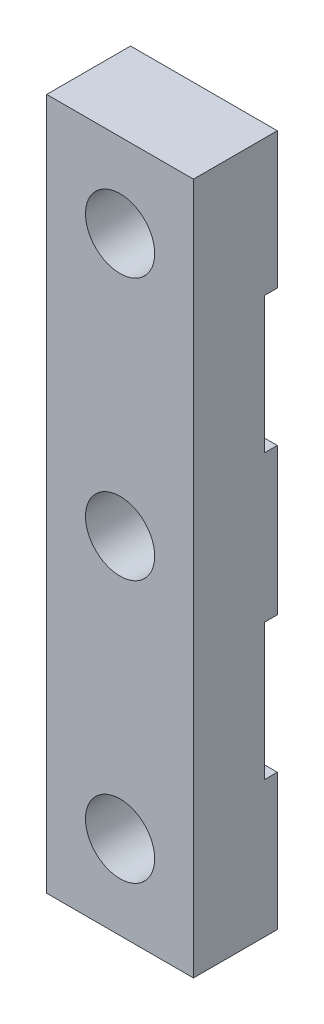
ISO-10303-21;
HEADER;
FILE_DESCRIPTION(('STEP AP214'),'2;1');
FILE_NAME('part.step','',(''),(''),'','','');
FILE_SCHEMA(('AUTOMOTIVE_DESIGN { 1 0 10303 214 1 1 1 1 }'));
ENDSEC;
DATA;
#1=APPLICATION_CONTEXT('core data for automotive mechanical design processes');
#2=APPLICATION_PROTOCOL_DEFINITION('international standard','automotive_design',2000,#1);
#3=PRODUCT_CONTEXT('',#1,'mechanical');
#4=PRODUCT('Part','Part','',(#3));
#5=PRODUCT_RELATED_PRODUCT_CATEGORY('part','',(#4));
#6=PRODUCT_DEFINITION_FORMATION('','',#4);
#7=PRODUCT_DEFINITION_CONTEXT('part definition',#1,'design');
#8=PRODUCT_DEFINITION('design','',#6,#7);
#9=PRODUCT_DEFINITION_SHAPE('','',#8);
#10=(LENGTH_UNIT() NAMED_UNIT(*) SI_UNIT(.MILLI.,.METRE.));
#11=(NAMED_UNIT(*) PLANE_ANGLE_UNIT() SI_UNIT($,.RADIAN.));
#12=(NAMED_UNIT(*) SI_UNIT($,.STERADIAN.) SOLID_ANGLE_UNIT());
#13=UNCERTAINTY_MEASURE_WITH_UNIT(LENGTH_MEASURE(1.E-05),#10,'distance_accuracy_value','');
#14=(GEOMETRIC_REPRESENTATION_CONTEXT(3) GLOBAL_UNCERTAINTY_ASSIGNED_CONTEXT((#13)) GLOBAL_UNIT_ASSIGNED_CONTEXT((#10,
#11,#12)) REPRESENTATION_CONTEXT('',''));
#15=CARTESIAN_POINT('',(0.,0.,0.));
#16=DIRECTION('',(0.,0.,1.));
#17=DIRECTION('',(1.,0.,0.));
#18=AXIS2_PLACEMENT_3D('',#15,#16,#17);
#19=CARTESIAN_POINT('',(0.,0.,0.));
#20=DIRECTION('',(0.,0.,1.));
#21=DIRECTION('',(1.,0.,0.));
#22=AXIS2_PLACEMENT_3D('',#19,#20,#21);
#23=PLANE('',#22);
#24=CARTESIAN_POINT('',(0.,12.5,0.));
#25=DIRECTION('',(0.,0.,1.));
#26=DIRECTION('',(1.,0.,0.));
#27=AXIS2_PLACEMENT_3D('',#24,#25,#26);
#28=CIRCLE('',#27,1.65);
#29=CARTESIAN_POINT('',(1.65,12.5,0.));
#30=VERTEX_POINT('',#29);
#31=EDGE_CURVE('E191',#30,#30,#28,.T.);
#32=ORIENTED_EDGE('',*,*,#31,.T.);
#33=EDGE_LOOP('',(#32));
#34=FACE_BOUND('',#33,.T.);
#35=DIRECTION('',(0.,1.,0.));
#36=VECTOR('',#35,1.);
#37=CARTESIAN_POINT('',(3.5,16.5,0.));
#38=LINE('',#37,#36);
#39=CARTESIAN_POINT('',(3.5,10.,0.));
#40=VERTEX_POINT('',#39);
#41=CARTESIAN_POINT('',(3.5,16.5,0.));
#42=VERTEX_POINT('',#41);
#43=EDGE_CURVE('E146',#40,#42,#38,.T.);
#44=ORIENTED_EDGE('',*,*,#43,.F.);
#45=DIRECTION('',(-1.,0.,0.));
#46=VECTOR('',#45,1.);
#47=CARTESIAN_POINT('',(3.5,10.,0.));
#48=LINE('',#47,#46);
#49=CARTESIAN_POINT('',(-3.5,10.,0.));
#50=VERTEX_POINT('',#49);
#51=EDGE_CURVE('E195',#40,#50,#48,.T.);
#52=ORIENTED_EDGE('',*,*,#51,.T.);
#53=DIRECTION('',(0.,-1.,0.));
#54=VECTOR('',#53,1.);
#55=CARTESIAN_POINT('',(-3.5,16.5,0.));
#56=LINE('',#55,#54);
#57=CARTESIAN_POINT('',(-3.5,16.5,0.));
#58=VERTEX_POINT('',#57);
#59=EDGE_CURVE('E212',#58,#50,#56,.T.);
#60=ORIENTED_EDGE('',*,*,#59,.F.);
#61=DIRECTION('',(-1.,0.,0.));
#62=VECTOR('',#61,1.);
#63=CARTESIAN_POINT('',(-3.5,16.5,0.));
#64=LINE('',#63,#62);
#65=EDGE_CURVE('E149',#42,#58,#64,.T.);
#66=ORIENTED_EDGE('',*,*,#65,.F.);
#67=EDGE_LOOP('',(#44,#52,#60,#66));
#68=FACE_BOUND('',#67,.T.);
#69=ADVANCED_FACE('F32',(#34,#68),#23,.F.);
#70=CARTESIAN_POINT('',(0.,0.,0.));
#71=DIRECTION('',(0.,0.,1.));
#72=DIRECTION('',(1.,0.,0.));
#73=AXIS2_PLACEMENT_3D('',#70,#71,#72);
#74=CIRCLE('',#73,1.65);
#75=CARTESIAN_POINT('',(1.65,0.,0.));
#76=VERTEX_POINT('',#75);
#77=EDGE_CURVE('E199',#76,#76,#74,.T.);
#78=ORIENTED_EDGE('',*,*,#77,.T.);
#79=EDGE_LOOP('',(#78));
#80=FACE_BOUND('',#79,.T.);
#81=CARTESIAN_POINT('',(-3.5,3.5,0.));
#82=VERTEX_POINT('',#81);
#83=CARTESIAN_POINT('',(-3.5,-3.5,0.));
#84=VERTEX_POINT('',#83);
#85=EDGE_CURVE('E138',#82,#84,#56,.T.);
#86=ORIENTED_EDGE('',*,*,#85,.F.);
#87=DIRECTION('',(-1.,0.,0.));
#88=VECTOR('',#87,1.);
#89=CARTESIAN_POINT('',(3.5,3.5,0.));
#90=LINE('',#89,#88);
#91=CARTESIAN_POINT('',(3.5,3.5,0.));
#92=VERTEX_POINT('',#91);
#93=EDGE_CURVE('E124',#92,#82,#90,.T.);
#94=ORIENTED_EDGE('',*,*,#93,.F.);
#95=CARTESIAN_POINT('',(3.5,-3.5,0.));
#96=VERTEX_POINT('',#95);
#97=EDGE_CURVE('E136',#96,#92,#38,.T.);
#98=ORIENTED_EDGE('',*,*,#97,.F.);
#99=DIRECTION('',(-1.,0.,0.));
#100=VECTOR('',#99,1.);
#101=CARTESIAN_POINT('',(3.5,-3.5,0.));
#102=LINE('',#101,#100);
#103=EDGE_CURVE('E231',#96,#84,#102,.T.);
#104=ORIENTED_EDGE('',*,*,#103,.T.);
#105=EDGE_LOOP('',(#86,#94,#98,#104));
#106=FACE_BOUND('',#105,.T.);
#107=ADVANCED_FACE('F134',(#80,#106),#23,.F.);
#108=CARTESIAN_POINT('',(0.,0.,4.));
#109=DIRECTION('',(0.,0.,1.));
#110=DIRECTION('',(1.,0.,0.));
#111=AXIS2_PLACEMENT_3D('',#108,#109,#110);
#112=PLANE('',#111);
#113=CARTESIAN_POINT('',(0.,12.5,4.));
#114=DIRECTION('',(0.,0.,1.));
#115=DIRECTION('',(1.,0.,0.));
#116=AXIS2_PLACEMENT_3D('',#113,#114,#115);
#117=CIRCLE('',#116,1.65);
#118=CARTESIAN_POINT('',(1.65,12.5,4.));
#119=VERTEX_POINT('',#118);
#120=EDGE_CURVE('E196',#119,#119,#117,.T.);
#121=ORIENTED_EDGE('',*,*,#120,.F.);
#122=EDGE_LOOP('',(#121));
#123=FACE_BOUND('',#122,.T.);
#124=DIRECTION('',(0.,-1.,0.));
#125=VECTOR('',#124,1.);
#126=CARTESIAN_POINT('',(-3.5,16.5,4.));
#127=LINE('',#126,#125);
#128=CARTESIAN_POINT('',(-3.5,16.5,4.));
#129=VERTEX_POINT('',#128);
#130=CARTESIAN_POINT('',(-3.5,-16.5,4.));
#131=VERTEX_POINT('',#130);
#132=EDGE_CURVE('E155',#129,#131,#127,.T.);
#133=ORIENTED_EDGE('',*,*,#132,.T.);
#134=DIRECTION('',(1.,0.,0.));
#135=VECTOR('',#134,1.);
#136=CARTESIAN_POINT('',(-3.5,-16.5,4.));
#137=LINE('',#136,#135);
#138=CARTESIAN_POINT('',(3.5,-16.5,4.));
#139=VERTEX_POINT('',#138);
#140=EDGE_CURVE('E209',#131,#139,#137,.T.);
#141=ORIENTED_EDGE('',*,*,#140,.T.);
#142=DIRECTION('',(0.,1.,0.));
#143=VECTOR('',#142,1.);
#144=CARTESIAN_POINT('',(3.5,16.5,4.));
#145=LINE('',#144,#143);
#146=CARTESIAN_POINT('',(3.5,16.5,4.));
#147=VERTEX_POINT('',#146);
#148=EDGE_CURVE('E168',#139,#147,#145,.T.);
#149=ORIENTED_EDGE('',*,*,#148,.T.);
#150=DIRECTION('',(-1.,0.,0.));
#151=VECTOR('',#150,1.);
#152=CARTESIAN_POINT('',(-3.5,16.5,4.));
#153=LINE('',#152,#151);
#154=EDGE_CURVE('E160',#147,#129,#153,.T.);
#155=ORIENTED_EDGE('',*,*,#154,.T.);
#156=EDGE_LOOP('',(#133,#141,#149,#155));
#157=FACE_BOUND('',#156,.T.);
#158=CARTESIAN_POINT('',(0.,0.,4.));
#159=DIRECTION('',(0.,0.,1.));
#160=DIRECTION('',(1.,0.,0.));
#161=AXIS2_PLACEMENT_3D('',#158,#159,#160);
#162=CIRCLE('',#161,1.65);
#163=CARTESIAN_POINT('',(1.65,0.,4.));
#164=VERTEX_POINT('',#163);
#165=EDGE_CURVE('E202',#164,#164,#162,.T.);
#166=ORIENTED_EDGE('',*,*,#165,.F.);
#167=EDGE_LOOP('',(#166));
#168=FACE_BOUND('',#167,.T.);
#169=CARTESIAN_POINT('',(0.,-12.5,4.));
#170=DIRECTION('',(0.,0.,1.));
#171=DIRECTION('',(1.,0.,0.));
#172=AXIS2_PLACEMENT_3D('',#169,#170,#171);
#173=CIRCLE('',#172,1.65);
#174=CARTESIAN_POINT('',(1.65,-12.5,4.));
#175=VERTEX_POINT('',#174);
#176=EDGE_CURVE('E188',#175,#175,#173,.T.);
#177=ORIENTED_EDGE('',*,*,#176,.F.);
#178=EDGE_LOOP('',(#177));
#179=FACE_BOUND('',#178,.T.);
#180=ADVANCED_FACE('F269',(#123,#157,#168,#179),#112,.T.);
#181=CARTESIAN_POINT('',(-3.5,-10.,0.));
#182=VERTEX_POINT('',#181);
#183=CARTESIAN_POINT('',(-3.5,-16.5,0.));
#184=VERTEX_POINT('',#183);
#185=EDGE_CURVE('E177',#182,#184,#56,.T.);
#186=ORIENTED_EDGE('',*,*,#185,.F.);
#187=DIRECTION('',(-1.,0.,0.));
#188=VECTOR('',#187,1.);
#189=CARTESIAN_POINT('',(3.5,-10.,0.));
#190=LINE('',#189,#188);
#191=CARTESIAN_POINT('',(3.5,-10.,0.));
#192=VERTEX_POINT('',#191);
#193=EDGE_CURVE('E176',#192,#182,#190,.T.);
#194=ORIENTED_EDGE('',*,*,#193,.F.);
#195=CARTESIAN_POINT('',(3.5,-16.5,0.));
#196=VERTEX_POINT('',#195);
#197=EDGE_CURVE('E145',#196,#192,#38,.T.);
#198=ORIENTED_EDGE('',*,*,#197,.F.);
#199=DIRECTION('',(1.,0.,0.));
#200=VECTOR('',#199,1.);
#201=CARTESIAN_POINT('',(-3.5,-16.5,0.));
#202=LINE('',#201,#200);
#203=EDGE_CURVE('E150',#184,#196,#202,.T.);
#204=ORIENTED_EDGE('',*,*,#203,.F.);
#205=EDGE_LOOP('',(#186,#194,#198,#204));
#206=FACE_BOUND('',#205,.T.);
#207=CARTESIAN_POINT('',(0.,-12.5,0.));
#208=DIRECTION('',(0.,0.,1.));
#209=DIRECTION('',(1.,0.,0.));
#210=AXIS2_PLACEMENT_3D('',#207,#208,#209);
#211=CIRCLE('',#210,1.65);
#212=CARTESIAN_POINT('',(1.65,-12.5,0.));
#213=VERTEX_POINT('',#212);
#214=EDGE_CURVE('E192',#213,#213,#211,.T.);
#215=ORIENTED_EDGE('',*,*,#214,.T.);
#216=EDGE_LOOP('',(#215));
#217=FACE_BOUND('',#216,.T.);
#218=ADVANCED_FACE('F174',(#206,#217),#23,.F.);
#219=CARTESIAN_POINT('',(-3.5,16.5,4.));
#220=DIRECTION('',(1.,0.,0.));
#221=DIRECTION('',(0.,0.,-1.));
#222=AXIS2_PLACEMENT_3D('',#219,#220,#221);
#223=PLANE('',#222);
#224=ORIENTED_EDGE('',*,*,#59,.T.);
#225=DIRECTION('',(0.,0.,-1.));
#226=VECTOR('',#225,1.);
#227=CARTESIAN_POINT('',(-3.5,10.,0.));
#228=LINE('',#227,#226);
#229=CARTESIAN_POINT('',(-3.5,10.,0.6));
#230=VERTEX_POINT('',#229);
#231=EDGE_CURVE('E129',#230,#50,#228,.T.);
#232=ORIENTED_EDGE('',*,*,#231,.F.);
#233=DIRECTION('',(0.,1.,0.));
#234=VECTOR('',#233,1.);
#235=CARTESIAN_POINT('',(-3.5,10.,0.6));
#236=LINE('',#235,#234);
#237=CARTESIAN_POINT('',(-3.5,3.5,0.600000000000001));
#238=VERTEX_POINT('',#237);
#239=EDGE_CURVE('E238',#238,#230,#236,.T.);
#240=ORIENTED_EDGE('',*,*,#239,.F.);
#241=DIRECTION('',(0.,0.,1.));
#242=VECTOR('',#241,1.);
#243=CARTESIAN_POINT('',(-3.5,3.5,0.));
#244=LINE('',#243,#242);
#245=EDGE_CURVE('E232',#82,#238,#244,.T.);
#246=ORIENTED_EDGE('',*,*,#245,.F.);
#247=ORIENTED_EDGE('',*,*,#85,.T.);
#248=DIRECTION('',(0.,0.,-1.));
#249=VECTOR('',#248,1.);
#250=CARTESIAN_POINT('',(-3.5,-3.5,0.));
#251=LINE('',#250,#249);
#252=CARTESIAN_POINT('',(-3.5,-3.5,0.600000000000002));
#253=VERTEX_POINT('',#252);
#254=EDGE_CURVE('E225',#253,#84,#251,.T.);
#255=ORIENTED_EDGE('',*,*,#254,.F.);
#256=DIRECTION('',(0.,1.,0.));
#257=VECTOR('',#256,1.);
#258=CARTESIAN_POINT('',(-3.5,-3.5,0.600000000000002));
#259=LINE('',#258,#257);
#260=CARTESIAN_POINT('',(-3.5,-10.,0.600000000000002));
#261=VERTEX_POINT('',#260);
#262=EDGE_CURVE('E223',#261,#253,#259,.T.);
#263=ORIENTED_EDGE('',*,*,#262,.F.);
#264=DIRECTION('',(0.,0.,1.));
#265=VECTOR('',#264,1.);
#266=CARTESIAN_POINT('',(-3.5,-10.,0.));
#267=LINE('',#266,#265);
#268=EDGE_CURVE('E220',#182,#261,#267,.T.);
#269=ORIENTED_EDGE('',*,*,#268,.F.);
#270=ORIENTED_EDGE('',*,*,#185,.T.);
#271=DIRECTION('',(0.,0.,-1.));
#272=VECTOR('',#271,1.);
#273=CARTESIAN_POINT('',(-3.5,-16.5,4.));
#274=LINE('',#273,#272);
#275=EDGE_CURVE('E11',#131,#184,#274,.T.);
#276=ORIENTED_EDGE('',*,*,#275,.F.);
#277=ORIENTED_EDGE('',*,*,#132,.F.);
#278=DIRECTION('',(0.,0.,-1.));
#279=VECTOR('',#278,1.);
#280=CARTESIAN_POINT('',(-3.5,16.5,4.));
#281=LINE('',#280,#279);
#282=EDGE_CURVE('E156',#129,#58,#281,.T.);
#283=ORIENTED_EDGE('',*,*,#282,.T.);
#284=EDGE_LOOP('',(#224,#232,#240,#246,#247,#255,#263,#269,#270,#276,#277,#283));
#285=FACE_BOUND('',#284,.T.);
#286=ADVANCED_FACE('F34',(#285),#223,.F.);
#287=CARTESIAN_POINT('',(-3.5,-16.5,4.));
#288=DIRECTION('',(0.,1.,0.));
#289=DIRECTION('',(0.,0.,1.));
#290=AXIS2_PLACEMENT_3D('',#287,#288,#289);
#291=PLANE('',#290);
#292=ORIENTED_EDGE('',*,*,#203,.T.);
#293=DIRECTION('',(0.,0.,-1.));
#294=VECTOR('',#293,1.);
#295=CARTESIAN_POINT('',(3.5,-16.5,4.));
#296=LINE('',#295,#294);
#297=EDGE_CURVE('E40',#139,#196,#296,.T.);
#298=ORIENTED_EDGE('',*,*,#297,.F.);
#299=ORIENTED_EDGE('',*,*,#140,.F.);
#300=ORIENTED_EDGE('',*,*,#275,.T.);
#301=EDGE_LOOP('',(#292,#298,#299,#300));
#302=FACE_BOUND('',#301,.T.);
#303=ADVANCED_FACE('F279',(#302),#291,.F.);
#304=CARTESIAN_POINT('',(3.5,16.5,4.));
#305=DIRECTION('',(-1.,0.,0.));
#306=DIRECTION('',(0.,0.,1.));
#307=AXIS2_PLACEMENT_3D('',#304,#305,#306);
#308=PLANE('',#307);
#309=DIRECTION('',(0.,1.,0.));
#310=VECTOR('',#309,1.);
#311=CARTESIAN_POINT('',(3.5,10.,0.6));
#312=LINE('',#311,#310);
#313=CARTESIAN_POINT('',(3.5,3.5,0.600000000000001));
#314=VERTEX_POINT('',#313);
#315=CARTESIAN_POINT('',(3.5,10.,0.6));
#316=VERTEX_POINT('',#315);
#317=EDGE_CURVE('E47',#314,#316,#312,.T.);
#318=ORIENTED_EDGE('',*,*,#317,.T.);
#319=DIRECTION('',(0.,0.,-1.));
#320=VECTOR('',#319,1.);
#321=CARTESIAN_POINT('',(3.5,10.,0.));
#322=LINE('',#321,#320);
#323=EDGE_CURVE('E139',#316,#40,#322,.T.);
#324=ORIENTED_EDGE('',*,*,#323,.T.);
#325=ORIENTED_EDGE('',*,*,#43,.T.);
#326=DIRECTION('',(0.,0.,-1.));
#327=VECTOR('',#326,1.);
#328=CARTESIAN_POINT('',(3.5,16.5,4.));
#329=LINE('',#328,#327);
#330=EDGE_CURVE('E159',#147,#42,#329,.T.);
#331=ORIENTED_EDGE('',*,*,#330,.F.);
#332=ORIENTED_EDGE('',*,*,#148,.F.);
#333=ORIENTED_EDGE('',*,*,#297,.T.);
#334=ORIENTED_EDGE('',*,*,#197,.T.);
#335=DIRECTION('',(0.,0.,1.));
#336=VECTOR('',#335,1.);
#337=CARTESIAN_POINT('',(3.5,-10.,0.));
#338=LINE('',#337,#336);
#339=CARTESIAN_POINT('',(3.5,-10.,0.600000000000002));
#340=VERTEX_POINT('',#339);
#341=EDGE_CURVE('E230',#192,#340,#338,.T.);
#342=ORIENTED_EDGE('',*,*,#341,.T.);
#343=DIRECTION('',(0.,1.,0.));
#344=VECTOR('',#343,1.);
#345=CARTESIAN_POINT('',(3.5,-3.5,0.600000000000002));
#346=LINE('',#345,#344);
#347=CARTESIAN_POINT('',(3.5,-3.5,0.600000000000002));
#348=VERTEX_POINT('',#347);
#349=EDGE_CURVE('E55',#340,#348,#346,.T.);
#350=ORIENTED_EDGE('',*,*,#349,.T.);
#351=DIRECTION('',(0.,0.,-1.));
#352=VECTOR('',#351,1.);
#353=CARTESIAN_POINT('',(3.5,-3.5,0.));
#354=LINE('',#353,#352);
#355=EDGE_CURVE('E144',#348,#96,#354,.T.);
#356=ORIENTED_EDGE('',*,*,#355,.T.);
#357=ORIENTED_EDGE('',*,*,#97,.T.);
#358=DIRECTION('',(0.,0.,1.));
#359=VECTOR('',#358,1.);
#360=CARTESIAN_POINT('',(3.5,3.5,0.));
#361=LINE('',#360,#359);
#362=EDGE_CURVE('E120',#92,#314,#361,.T.);
#363=ORIENTED_EDGE('',*,*,#362,.T.);
#364=EDGE_LOOP('',(#318,#324,#325,#331,#332,#333,#334,#342,#350,#356,#357,#363));
#365=FACE_BOUND('',#364,.T.);
#366=ADVANCED_FACE('F142',(#365),#308,.F.);
#367=CARTESIAN_POINT('',(-3.5,16.5,4.));
#368=DIRECTION('',(0.,-1.,0.));
#369=DIRECTION('',(0.,0.,-1.));
#370=AXIS2_PLACEMENT_3D('',#367,#368,#369);
#371=PLANE('',#370);
#372=ORIENTED_EDGE('',*,*,#65,.T.);
#373=ORIENTED_EDGE('',*,*,#282,.F.);
#374=ORIENTED_EDGE('',*,*,#154,.F.);
#375=ORIENTED_EDGE('',*,*,#330,.T.);
#376=EDGE_LOOP('',(#372,#373,#374,#375));
#377=FACE_BOUND('',#376,.T.);
#378=ADVANCED_FACE('F290',(#377),#371,.F.);
#379=CARTESIAN_POINT('',(0.,0.,4.));
#380=DIRECTION('',(0.,0.,-1.));
#381=DIRECTION('',(-1.,0.,0.));
#382=AXIS2_PLACEMENT_3D('',#379,#380,#381);
#383=CYLINDRICAL_SURFACE('',#382,1.65);
#384=ORIENTED_EDGE('',*,*,#165,.T.);
#385=EDGE_LOOP('',(#384));
#386=FACE_BOUND('',#385,.T.);
#387=ORIENTED_EDGE('',*,*,#77,.F.);
#388=EDGE_LOOP('',(#387));
#389=FACE_BOUND('',#388,.T.);
#390=ADVANCED_FACE('F286',(#386,#389),#383,.F.);
#391=CARTESIAN_POINT('',(0.,12.5,4.));
#392=DIRECTION('',(0.,0.,-1.));
#393=DIRECTION('',(-1.,0.,0.));
#394=AXIS2_PLACEMENT_3D('',#391,#392,#393);
#395=CYLINDRICAL_SURFACE('',#394,1.65);
#396=ORIENTED_EDGE('',*,*,#120,.T.);
#397=EDGE_LOOP('',(#396));
#398=FACE_BOUND('',#397,.T.);
#399=ORIENTED_EDGE('',*,*,#31,.F.);
#400=EDGE_LOOP('',(#399));
#401=FACE_BOUND('',#400,.T.);
#402=ADVANCED_FACE('F289',(#398,#401),#395,.F.);
#403=CARTESIAN_POINT('',(0.,-12.5,4.));
#404=DIRECTION('',(0.,0.,-1.));
#405=DIRECTION('',(-1.,0.,0.));
#406=AXIS2_PLACEMENT_3D('',#403,#404,#405);
#407=CYLINDRICAL_SURFACE('',#406,1.65);
#408=ORIENTED_EDGE('',*,*,#176,.T.);
#409=EDGE_LOOP('',(#408));
#410=FACE_BOUND('',#409,.T.);
#411=ORIENTED_EDGE('',*,*,#214,.F.);
#412=EDGE_LOOP('',(#411));
#413=FACE_BOUND('',#412,.T.);
#414=ADVANCED_FACE('F293',(#410,#413),#407,.F.);
#415=CARTESIAN_POINT('',(3.5,-3.5,0.));
#416=DIRECTION('',(0.,1.,0.));
#417=DIRECTION('',(0.,0.,1.));
#418=AXIS2_PLACEMENT_3D('',#415,#416,#417);
#419=PLANE('',#418);
#420=ORIENTED_EDGE('',*,*,#254,.T.);
#421=ORIENTED_EDGE('',*,*,#103,.F.);
#422=ORIENTED_EDGE('',*,*,#355,.F.);
#423=DIRECTION('',(-1.,0.,0.));
#424=VECTOR('',#423,1.);
#425=CARTESIAN_POINT('',(3.5,-3.5,0.600000000000002));
#426=LINE('',#425,#424);
#427=EDGE_CURVE('E183',#348,#253,#426,.T.);
#428=ORIENTED_EDGE('',*,*,#427,.T.);
#429=EDGE_LOOP('',(#420,#421,#422,#428));
#430=FACE_BOUND('',#429,.T.);
#431=ADVANCED_FACE('F234',(#430),#419,.F.);
#432=CARTESIAN_POINT('',(3.5,-3.5,0.600000000000002));
#433=DIRECTION('',(0.,0.,1.));
#434=DIRECTION('',(0.,-1.,0.));
#435=AXIS2_PLACEMENT_3D('',#432,#433,#434);
#436=PLANE('',#435);
#437=ORIENTED_EDGE('',*,*,#262,.T.);
#438=ORIENTED_EDGE('',*,*,#427,.F.);
#439=ORIENTED_EDGE('',*,*,#349,.F.);
#440=DIRECTION('',(-1.,0.,0.));
#441=VECTOR('',#440,1.);
#442=CARTESIAN_POINT('',(3.5,-10.,0.600000000000002));
#443=LINE('',#442,#441);
#444=EDGE_CURVE('E181',#340,#261,#443,.T.);
#445=ORIENTED_EDGE('',*,*,#444,.T.);
#446=EDGE_LOOP('',(#437,#438,#439,#445));
#447=FACE_BOUND('',#446,.T.);
#448=ADVANCED_FACE('F235',(#447),#436,.F.);
#449=CARTESIAN_POINT('',(3.5,-10.,0.));
#450=DIRECTION('',(0.,-1.,0.));
#451=DIRECTION('',(0.,0.,-1.));
#452=AXIS2_PLACEMENT_3D('',#449,#450,#451);
#453=PLANE('',#452);
#454=ORIENTED_EDGE('',*,*,#268,.T.);
#455=ORIENTED_EDGE('',*,*,#444,.F.);
#456=ORIENTED_EDGE('',*,*,#341,.F.);
#457=ORIENTED_EDGE('',*,*,#193,.T.);
#458=EDGE_LOOP('',(#454,#455,#456,#457));
#459=FACE_BOUND('',#458,.T.);
#460=ADVANCED_FACE('F250',(#459),#453,.F.);
#461=CARTESIAN_POINT('',(3.5,10.,0.));
#462=DIRECTION('',(0.,1.,0.));
#463=DIRECTION('',(0.,0.,1.));
#464=AXIS2_PLACEMENT_3D('',#461,#462,#463);
#465=PLANE('',#464);
#466=ORIENTED_EDGE('',*,*,#231,.T.);
#467=ORIENTED_EDGE('',*,*,#51,.F.);
#468=ORIENTED_EDGE('',*,*,#323,.F.);
#469=DIRECTION('',(-1.,0.,0.));
#470=VECTOR('',#469,1.);
#471=CARTESIAN_POINT('',(3.5,10.,0.6));
#472=LINE('',#471,#470);
#473=EDGE_CURVE('E247',#316,#230,#472,.T.);
#474=ORIENTED_EDGE('',*,*,#473,.T.);
#475=EDGE_LOOP('',(#466,#467,#468,#474));
#476=FACE_BOUND('',#475,.T.);
#477=ADVANCED_FACE('F252',(#476),#465,.F.);
#478=CARTESIAN_POINT('',(3.5,10.,0.6));
#479=DIRECTION('',(0.,0.,1.));
#480=DIRECTION('',(0.,-1.,0.));
#481=AXIS2_PLACEMENT_3D('',#478,#479,#480);
#482=PLANE('',#481);
#483=ORIENTED_EDGE('',*,*,#239,.T.);
#484=ORIENTED_EDGE('',*,*,#473,.F.);
#485=ORIENTED_EDGE('',*,*,#317,.F.);
#486=DIRECTION('',(-1.,0.,0.));
#487=VECTOR('',#486,1.);
#488=CARTESIAN_POINT('',(3.5,3.5,0.600000000000001));
#489=LINE('',#488,#487);
#490=EDGE_CURVE('E126',#314,#238,#489,.T.);
#491=ORIENTED_EDGE('',*,*,#490,.T.);
#492=EDGE_LOOP('',(#483,#484,#485,#491));
#493=FACE_BOUND('',#492,.T.);
#494=ADVANCED_FACE('F258',(#493),#482,.F.);
#495=CARTESIAN_POINT('',(3.5,3.5,0.));
#496=DIRECTION('',(0.,-1.,0.));
#497=DIRECTION('',(0.,0.,-1.));
#498=AXIS2_PLACEMENT_3D('',#495,#496,#497);
#499=PLANE('',#498);
#500=ORIENTED_EDGE('',*,*,#245,.T.);
#501=ORIENTED_EDGE('',*,*,#490,.F.);
#502=ORIENTED_EDGE('',*,*,#362,.F.);
#503=ORIENTED_EDGE('',*,*,#93,.T.);
#504=EDGE_LOOP('',(#500,#501,#502,#503));
#505=FACE_BOUND('',#504,.T.);
#506=ADVANCED_FACE('F123',(#505),#499,.F.);
#507=CLOSED_SHELL('',(#69,#107,#180,#218,#286,#303,#366,#378,#390,#402,#414,#431,#448,#460,#477,
#494,#506));
#508=MANIFOLD_SOLID_BREP('B2',#507);
#509=ADVANCED_BREP_SHAPE_REPRESENTATION('',(#18,#508),#14);
#510=SHAPE_DEFINITION_REPRESENTATION(#9,#509);
ENDSEC;
END-ISO-10303-21;
